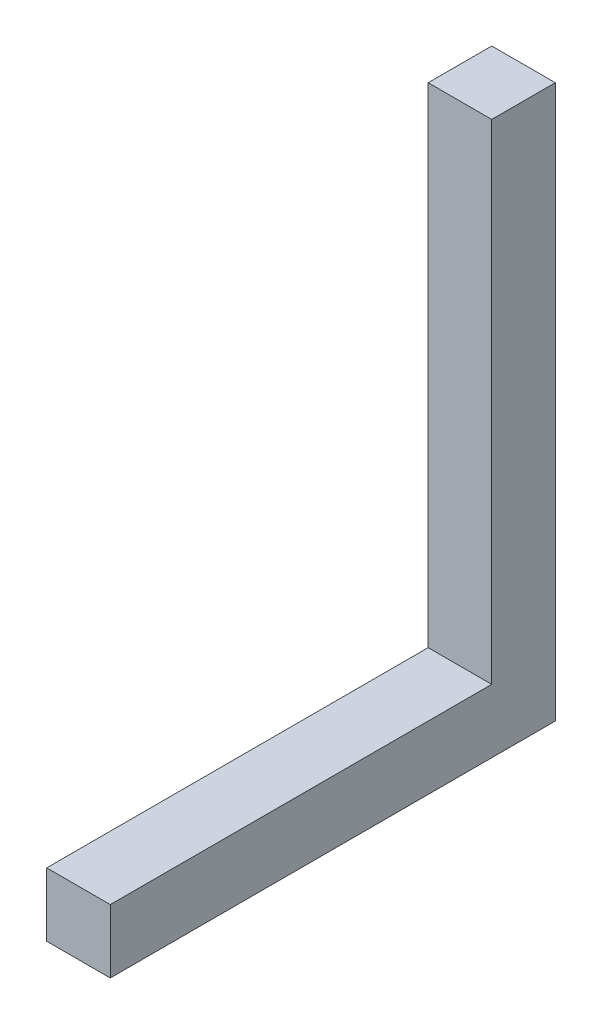
ISO-10303-21;
HEADER;
FILE_DESCRIPTION(('STEP AP214'),'2;1');
FILE_NAME('part.step','',(''),(''),'','','');
FILE_SCHEMA(('AUTOMOTIVE_DESIGN { 1 0 10303 214 1 1 1 1 }'));
ENDSEC;
DATA;
#1=APPLICATION_CONTEXT('core data for automotive mechanical design processes');
#2=APPLICATION_PROTOCOL_DEFINITION('international standard','automotive_design',2000,#1);
#3=PRODUCT_CONTEXT('',#1,'mechanical');
#4=PRODUCT('Part','Part','',(#3));
#5=PRODUCT_RELATED_PRODUCT_CATEGORY('part','',(#4));
#6=PRODUCT_DEFINITION_FORMATION('','',#4);
#7=PRODUCT_DEFINITION_CONTEXT('part definition',#1,'design');
#8=PRODUCT_DEFINITION('design','',#6,#7);
#9=PRODUCT_DEFINITION_SHAPE('','',#8);
#10=(LENGTH_UNIT() NAMED_UNIT(*) SI_UNIT(.MILLI.,.METRE.));
#11=(NAMED_UNIT(*) PLANE_ANGLE_UNIT() SI_UNIT($,.RADIAN.));
#12=(NAMED_UNIT(*) SI_UNIT($,.STERADIAN.) SOLID_ANGLE_UNIT());
#13=UNCERTAINTY_MEASURE_WITH_UNIT(LENGTH_MEASURE(1.E-05),#10,'distance_accuracy_value','');
#14=(GEOMETRIC_REPRESENTATION_CONTEXT(3) GLOBAL_UNCERTAINTY_ASSIGNED_CONTEXT((#13)) GLOBAL_UNIT_ASSIGNED_CONTEXT((#10,
#11,#12)) REPRESENTATION_CONTEXT('',''));
#15=CARTESIAN_POINT('',(0.,0.,0.));
#16=DIRECTION('',(0.,0.,1.));
#17=DIRECTION('',(1.,0.,0.));
#18=AXIS2_PLACEMENT_3D('',#15,#16,#17);
#19=CARTESIAN_POINT('',(-5.75,5.75,69.));
#20=DIRECTION('',(1.,0.,0.));
#21=DIRECTION('',(0.,1.,0.));
#22=AXIS2_PLACEMENT_3D('',#19,#20,#21);
#23=PLANE('',#22);
#24=DIRECTION('',(0.,0.,-1.));
#25=VECTOR('',#24,1.);
#26=CARTESIAN_POINT('',(-5.75,5.75,69.));
#27=LINE('',#26,#25);
#28=CARTESIAN_POINT('',(-5.75,5.75,69.));
#29=VERTEX_POINT('',#28);
#30=CARTESIAN_POINT('',(-5.75,5.75,0.));
#31=VERTEX_POINT('',#30);
#32=EDGE_CURVE('E140',#29,#31,#27,.T.);
#33=ORIENTED_EDGE('',*,*,#32,.T.);
#34=DIRECTION('',(0.,-1.,0.));
#35=VECTOR('',#34,1.);
#36=CARTESIAN_POINT('',(-5.75,94.25,0.));
#37=LINE('',#36,#35);
#38=CARTESIAN_POINT('',(-5.75,94.25,0.));
#39=VERTEX_POINT('',#38);
#40=EDGE_CURVE('E127',#39,#31,#37,.T.);
#41=ORIENTED_EDGE('',*,*,#40,.F.);
#42=DIRECTION('',(0.,0.,1.));
#43=VECTOR('',#42,1.);
#44=CARTESIAN_POINT('',(-5.75,94.25,69.));
#45=LINE('',#44,#43);
#46=CARTESIAN_POINT('',(-5.75,94.25,-11.5));
#47=VERTEX_POINT('',#46);
#48=EDGE_CURVE('E102',#47,#39,#45,.T.);
#49=ORIENTED_EDGE('',*,*,#48,.F.);
#50=DIRECTION('',(0.,-1.,0.));
#51=VECTOR('',#50,1.);
#52=CARTESIAN_POINT('',(-5.75,94.25,-11.5));
#53=LINE('',#52,#51);
#54=CARTESIAN_POINT('',(-5.75,-5.75,-11.5));
#55=VERTEX_POINT('',#54);
#56=EDGE_CURVE('E98',#47,#55,#53,.T.);
#57=ORIENTED_EDGE('',*,*,#56,.T.);
#58=DIRECTION('',(0.,0.,-1.));
#59=VECTOR('',#58,1.);
#60=CARTESIAN_POINT('',(-5.75,-5.75,69.));
#61=LINE('',#60,#59);
#62=CARTESIAN_POINT('',(-5.75,-5.75,69.));
#63=VERTEX_POINT('',#62);
#64=EDGE_CURVE('E11',#63,#55,#61,.T.);
#65=ORIENTED_EDGE('',*,*,#64,.F.);
#66=DIRECTION('',(0.,-1.,0.));
#67=VECTOR('',#66,1.);
#68=CARTESIAN_POINT('',(-5.75,5.75,69.));
#69=LINE('',#68,#67);
#70=EDGE_CURVE('E125',#29,#63,#69,.T.);
#71=ORIENTED_EDGE('',*,*,#70,.F.);
#72=EDGE_LOOP('',(#33,#41,#49,#57,#65,#71));
#73=FACE_BOUND('',#72,.T.);
#74=ADVANCED_FACE('F43',(#73),#23,.F.);
#75=CARTESIAN_POINT('',(5.75,-5.75,69.));
#76=DIRECTION('',(0.,1.,0.));
#77=DIRECTION('',(-1.,0.,0.));
#78=AXIS2_PLACEMENT_3D('',#75,#76,#77);
#79=PLANE('',#78);
#80=ORIENTED_EDGE('',*,*,#64,.T.);
#81=DIRECTION('',(-1.,0.,0.));
#82=VECTOR('',#81,1.);
#83=CARTESIAN_POINT('',(5.74999999999999,-5.75,-11.5));
#84=LINE('',#83,#82);
#85=CARTESIAN_POINT('',(5.75,-5.75,-11.5));
#86=VERTEX_POINT('',#85);
#87=EDGE_CURVE('E113',#86,#55,#84,.T.);
#88=ORIENTED_EDGE('',*,*,#87,.F.);
#89=DIRECTION('',(0.,0.,-1.));
#90=VECTOR('',#89,1.);
#91=CARTESIAN_POINT('',(5.75,-5.75,69.));
#92=LINE('',#91,#90);
#93=CARTESIAN_POINT('',(5.75,-5.75,69.));
#94=VERTEX_POINT('',#93);
#95=EDGE_CURVE('E52',#94,#86,#92,.T.);
#96=ORIENTED_EDGE('',*,*,#95,.F.);
#97=DIRECTION('',(1.,0.,0.));
#98=VECTOR('',#97,1.);
#99=CARTESIAN_POINT('',(5.75,-5.75,69.));
#100=LINE('',#99,#98);
#101=EDGE_CURVE('E133',#63,#94,#100,.T.);
#102=ORIENTED_EDGE('',*,*,#101,.F.);
#103=EDGE_LOOP('',(#80,#88,#96,#102));
#104=FACE_BOUND('',#103,.T.);
#105=ADVANCED_FACE('F178',(#104),#79,.F.);
#106=CARTESIAN_POINT('',(5.75,5.75,69.));
#107=DIRECTION('',(-1.,0.,0.));
#108=DIRECTION('',(0.,-1.,0.));
#109=AXIS2_PLACEMENT_3D('',#106,#107,#108);
#110=PLANE('',#109);
#111=ORIENTED_EDGE('',*,*,#95,.T.);
#112=DIRECTION('',(0.,-1.,0.));
#113=VECTOR('',#112,1.);
#114=CARTESIAN_POINT('',(5.75,94.25,-11.5));
#115=LINE('',#114,#113);
#116=CARTESIAN_POINT('',(5.75,94.25,-11.5));
#117=VERTEX_POINT('',#116);
#118=EDGE_CURVE('E96',#117,#86,#115,.T.);
#119=ORIENTED_EDGE('',*,*,#118,.F.);
#120=DIRECTION('',(0.,0.,-1.));
#121=VECTOR('',#120,1.);
#122=CARTESIAN_POINT('',(5.75,94.25,69.));
#123=LINE('',#122,#121);
#124=CARTESIAN_POINT('',(5.75,94.25,0.));
#125=VERTEX_POINT('',#124);
#126=EDGE_CURVE('E103',#125,#117,#123,.T.);
#127=ORIENTED_EDGE('',*,*,#126,.F.);
#128=DIRECTION('',(0.,-1.,0.));
#129=VECTOR('',#128,1.);
#130=CARTESIAN_POINT('',(5.75,94.25,0.));
#131=LINE('',#130,#129);
#132=CARTESIAN_POINT('',(5.75,5.75000000000001,0.));
#133=VERTEX_POINT('',#132);
#134=EDGE_CURVE('E152',#125,#133,#131,.T.);
#135=ORIENTED_EDGE('',*,*,#134,.T.);
#136=DIRECTION('',(0.,0.,-1.));
#137=VECTOR('',#136,1.);
#138=CARTESIAN_POINT('',(5.75,5.75,69.));
#139=LINE('',#138,#137);
#140=CARTESIAN_POINT('',(5.75,5.75,69.));
#141=VERTEX_POINT('',#140);
#142=EDGE_CURVE('E145',#141,#133,#139,.T.);
#143=ORIENTED_EDGE('',*,*,#142,.F.);
#144=DIRECTION('',(0.,1.,0.));
#145=VECTOR('',#144,1.);
#146=CARTESIAN_POINT('',(5.75,5.75,69.));
#147=LINE('',#146,#145);
#148=EDGE_CURVE('E136',#94,#141,#147,.T.);
#149=ORIENTED_EDGE('',*,*,#148,.F.);
#150=EDGE_LOOP('',(#111,#119,#127,#135,#143,#149));
#151=FACE_BOUND('',#150,.T.);
#152=ADVANCED_FACE('F115',(#151),#110,.F.);
#153=CARTESIAN_POINT('',(5.75,5.75,69.));
#154=DIRECTION('',(0.,-1.,0.));
#155=DIRECTION('',(1.,0.,0.));
#156=AXIS2_PLACEMENT_3D('',#153,#154,#155);
#157=PLANE('',#156);
#158=DIRECTION('',(-1.,0.,0.));
#159=VECTOR('',#158,1.);
#160=CARTESIAN_POINT('',(5.75,5.75,0.));
#161=LINE('',#160,#159);
#162=EDGE_CURVE('E120',#133,#31,#161,.T.);
#163=ORIENTED_EDGE('',*,*,#162,.T.);
#164=ORIENTED_EDGE('',*,*,#32,.F.);
#165=DIRECTION('',(-1.,0.,0.));
#166=VECTOR('',#165,1.);
#167=CARTESIAN_POINT('',(5.75,5.75,69.));
#168=LINE('',#167,#166);
#169=EDGE_CURVE('E59',#141,#29,#168,.T.);
#170=ORIENTED_EDGE('',*,*,#169,.F.);
#171=ORIENTED_EDGE('',*,*,#142,.T.);
#172=EDGE_LOOP('',(#163,#164,#170,#171));
#173=FACE_BOUND('',#172,.T.);
#174=ADVANCED_FACE('F151',(#173),#157,.F.);
#175=CARTESIAN_POINT('',(0.,0.,69.));
#176=DIRECTION('',(0.,0.,-1.));
#177=DIRECTION('',(-1.,0.,0.));
#178=AXIS2_PLACEMENT_3D('',#175,#176,#177);
#179=PLANE('',#178);
#180=ORIENTED_EDGE('',*,*,#70,.T.);
#181=ORIENTED_EDGE('',*,*,#101,.T.);
#182=ORIENTED_EDGE('',*,*,#148,.T.);
#183=ORIENTED_EDGE('',*,*,#169,.T.);
#184=EDGE_LOOP('',(#180,#181,#182,#183));
#185=FACE_BOUND('',#184,.T.);
#186=ADVANCED_FACE('F175',(#185),#179,.F.);
#187=CARTESIAN_POINT('',(5.74999999999999,94.25,-11.5));
#188=DIRECTION('',(0.,0.,1.));
#189=DIRECTION('',(1.,0.,0.));
#190=AXIS2_PLACEMENT_3D('',#187,#188,#189);
#191=PLANE('',#190);
#192=ORIENTED_EDGE('',*,*,#87,.T.);
#193=ORIENTED_EDGE('',*,*,#56,.F.);
#194=DIRECTION('',(-1.,0.,0.));
#195=VECTOR('',#194,1.);
#196=CARTESIAN_POINT('',(5.74999999999999,94.25,-11.5));
#197=LINE('',#196,#195);
#198=EDGE_CURVE('E91',#117,#47,#197,.T.);
#199=ORIENTED_EDGE('',*,*,#198,.F.);
#200=ORIENTED_EDGE('',*,*,#118,.T.);
#201=EDGE_LOOP('',(#192,#193,#199,#200));
#202=FACE_BOUND('',#201,.T.);
#203=ADVANCED_FACE('F94',(#202),#191,.F.);
#204=CARTESIAN_POINT('',(5.74999999999999,94.25,0.));
#205=DIRECTION('',(0.,0.,-1.));
#206=DIRECTION('',(-1.,0.,0.));
#207=AXIS2_PLACEMENT_3D('',#204,#205,#206);
#208=PLANE('',#207);
#209=ORIENTED_EDGE('',*,*,#162,.F.);
#210=ORIENTED_EDGE('',*,*,#134,.F.);
#211=DIRECTION('',(1.,0.,0.));
#212=VECTOR('',#211,1.);
#213=CARTESIAN_POINT('',(5.74999999999999,94.25,0.));
#214=LINE('',#213,#212);
#215=EDGE_CURVE('E108',#39,#125,#214,.T.);
#216=ORIENTED_EDGE('',*,*,#215,.F.);
#217=ORIENTED_EDGE('',*,*,#40,.T.);
#218=EDGE_LOOP('',(#209,#210,#216,#217));
#219=FACE_BOUND('',#218,.T.);
#220=ADVANCED_FACE('F167',(#219),#208,.F.);
#221=CARTESIAN_POINT('',(0.,94.25,0.));
#222=DIRECTION('',(0.,1.,0.));
#223=DIRECTION('',(-1.,0.,0.));
#224=AXIS2_PLACEMENT_3D('',#221,#222,#223);
#225=PLANE('',#224);
#226=ORIENTED_EDGE('',*,*,#126,.T.);
#227=ORIENTED_EDGE('',*,*,#198,.T.);
#228=ORIENTED_EDGE('',*,*,#48,.T.);
#229=ORIENTED_EDGE('',*,*,#215,.T.);
#230=EDGE_LOOP('',(#226,#227,#228,#229));
#231=FACE_BOUND('',#230,.T.);
#232=ADVANCED_FACE('F106',(#231),#225,.T.);
#233=CLOSED_SHELL('',(#74,#105,#152,#174,#186,#203,#220,#232));
#234=MANIFOLD_SOLID_BREP('B2',#233);
#235=ADVANCED_BREP_SHAPE_REPRESENTATION('',(#18,#234),#14);
#236=SHAPE_DEFINITION_REPRESENTATION(#9,#235);
ENDSEC;
END-ISO-10303-21;
